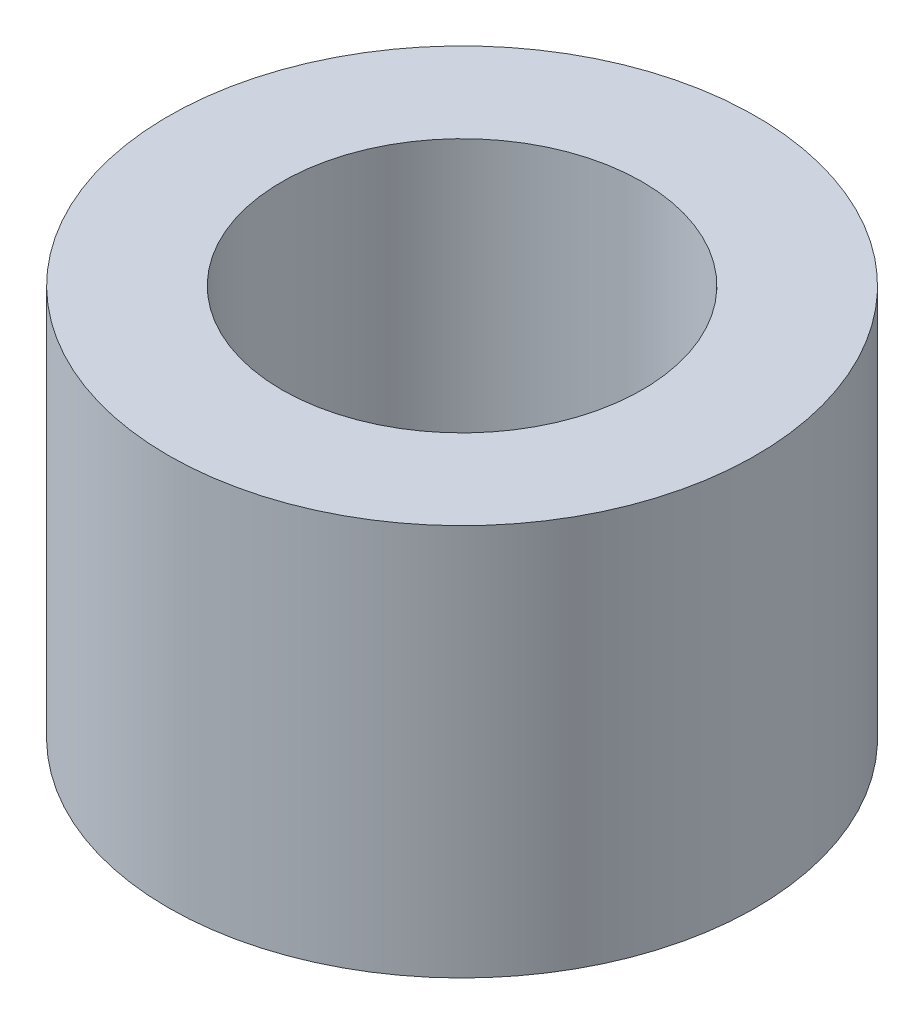
ISO-10303-21;
HEADER;
FILE_DESCRIPTION(('STEP AP214'),'2;1');
FILE_NAME('part.step','',(''),(''),'','','');
FILE_SCHEMA(('AUTOMOTIVE_DESIGN { 1 0 10303 214 1 1 1 1 }'));
ENDSEC;
DATA;
#1=APPLICATION_CONTEXT('core data for automotive mechanical design processes');
#2=APPLICATION_PROTOCOL_DEFINITION('international standard','automotive_design',2000,#1);
#3=PRODUCT_CONTEXT('',#1,'mechanical');
#4=PRODUCT('Part','Part','',(#3));
#5=PRODUCT_RELATED_PRODUCT_CATEGORY('part','',(#4));
#6=PRODUCT_DEFINITION_FORMATION('','',#4);
#7=PRODUCT_DEFINITION_CONTEXT('part definition',#1,'design');
#8=PRODUCT_DEFINITION('design','',#6,#7);
#9=PRODUCT_DEFINITION_SHAPE('','',#8);
#10=(LENGTH_UNIT() NAMED_UNIT(*) SI_UNIT(.MILLI.,.METRE.));
#11=(NAMED_UNIT(*) PLANE_ANGLE_UNIT() SI_UNIT($,.RADIAN.));
#12=(NAMED_UNIT(*) SI_UNIT($,.STERADIAN.) SOLID_ANGLE_UNIT());
#13=UNCERTAINTY_MEASURE_WITH_UNIT(LENGTH_MEASURE(1.E-05),#10,'distance_accuracy_value','');
#14=(GEOMETRIC_REPRESENTATION_CONTEXT(3) GLOBAL_UNCERTAINTY_ASSIGNED_CONTEXT((#13)) GLOBAL_UNIT_ASSIGNED_CONTEXT((#10,
#11,#12)) REPRESENTATION_CONTEXT('',''));
#15=CARTESIAN_POINT('',(0.,0.,0.));
#16=DIRECTION('',(0.,0.,1.));
#17=DIRECTION('',(1.,0.,0.));
#18=AXIS2_PLACEMENT_3D('',#15,#16,#17);
#19=CARTESIAN_POINT('',(0.,3.175,0.));
#20=DIRECTION('',(0.,1.,0.));
#21=DIRECTION('',(0.,0.,1.));
#22=AXIS2_PLACEMENT_3D('',#19,#20,#21);
#23=PLANE('',#22);
#24=CARTESIAN_POINT('',(0.,3.175,0.));
#25=DIRECTION('',(0.,1.,0.));
#26=DIRECTION('',(0.,0.,1.));
#27=AXIS2_PLACEMENT_3D('',#24,#25,#26);
#28=CIRCLE('',#27,2.38125);
#29=CARTESIAN_POINT('',(0.,3.175,2.38125));
#30=VERTEX_POINT('',#29);
#31=EDGE_CURVE('E10',#30,#30,#28,.T.);
#32=ORIENTED_EDGE('',*,*,#31,.T.);
#33=EDGE_LOOP('',(#32));
#34=FACE_BOUND('',#33,.T.);
#35=CARTESIAN_POINT('',(0.,3.175,0.));
#36=DIRECTION('',(0.,1.,0.));
#37=DIRECTION('',(0.,0.,1.));
#38=AXIS2_PLACEMENT_3D('',#35,#36,#37);
#39=CIRCLE('',#38,1.4605);
#40=CARTESIAN_POINT('',(0.,3.175,1.4605));
#41=VERTEX_POINT('',#40);
#42=EDGE_CURVE('E41',#41,#41,#39,.T.);
#43=ORIENTED_EDGE('',*,*,#42,.F.);
#44=EDGE_LOOP('',(#43));
#45=FACE_BOUND('',#44,.T.);
#46=ADVANCED_FACE('F30',(#34,#45),#23,.T.);
#47=CARTESIAN_POINT('',(0.,0.,0.));
#48=DIRECTION('',(0.,1.,0.));
#49=DIRECTION('',(0.,0.,1.));
#50=AXIS2_PLACEMENT_3D('',#47,#48,#49);
#51=PLANE('',#50);
#52=CARTESIAN_POINT('',(0.,0.,0.));
#53=DIRECTION('',(0.,1.,0.));
#54=DIRECTION('',(0.,0.,1.));
#55=AXIS2_PLACEMENT_3D('',#52,#53,#54);
#56=CIRCLE('',#55,2.38125);
#57=CARTESIAN_POINT('',(0.,0.,2.38125));
#58=VERTEX_POINT('',#57);
#59=EDGE_CURVE('E34',#58,#58,#56,.T.);
#60=ORIENTED_EDGE('',*,*,#59,.F.);
#61=EDGE_LOOP('',(#60));
#62=FACE_BOUND('',#61,.T.);
#63=CARTESIAN_POINT('',(0.,0.,0.));
#64=DIRECTION('',(0.,1.,0.));
#65=DIRECTION('',(0.,0.,1.));
#66=AXIS2_PLACEMENT_3D('',#63,#64,#65);
#67=CIRCLE('',#66,1.4605);
#68=CARTESIAN_POINT('',(0.,0.,1.4605));
#69=VERTEX_POINT('',#68);
#70=EDGE_CURVE('E43',#69,#69,#67,.T.);
#71=ORIENTED_EDGE('',*,*,#70,.T.);
#72=EDGE_LOOP('',(#71));
#73=FACE_BOUND('',#72,.T.);
#74=ADVANCED_FACE('F53',(#62,#73),#51,.F.);
#75=CARTESIAN_POINT('',(0.,3.175,0.));
#76=DIRECTION('',(0.,-1.,0.));
#77=DIRECTION('',(0.,0.,-1.));
#78=AXIS2_PLACEMENT_3D('',#75,#76,#77);
#79=CYLINDRICAL_SURFACE('',#78,2.38125);
#80=ORIENTED_EDGE('',*,*,#31,.F.);
#81=EDGE_LOOP('',(#80));
#82=FACE_BOUND('',#81,.T.);
#83=ORIENTED_EDGE('',*,*,#59,.T.);
#84=EDGE_LOOP('',(#83));
#85=FACE_BOUND('',#84,.T.);
#86=ADVANCED_FACE('F32',(#82,#85),#79,.T.);
#87=CARTESIAN_POINT('',(0.,3.175,0.));
#88=DIRECTION('',(0.,-1.,0.));
#89=DIRECTION('',(0.,0.,-1.));
#90=AXIS2_PLACEMENT_3D('',#87,#88,#89);
#91=CYLINDRICAL_SURFACE('',#90,1.4605);
#92=ORIENTED_EDGE('',*,*,#42,.T.);
#93=EDGE_LOOP('',(#92));
#94=FACE_BOUND('',#93,.T.);
#95=ORIENTED_EDGE('',*,*,#70,.F.);
#96=EDGE_LOOP('',(#95));
#97=FACE_BOUND('',#96,.T.);
#98=ADVANCED_FACE('F49',(#94,#97),#91,.F.);
#99=CLOSED_SHELL('',(#46,#74,#86,#98));
#100=MANIFOLD_SOLID_BREP('B2',#99);
#101=ADVANCED_BREP_SHAPE_REPRESENTATION('',(#18,#100),#14);
#102=SHAPE_DEFINITION_REPRESENTATION(#9,#101);
ENDSEC;
END-ISO-10303-21;
